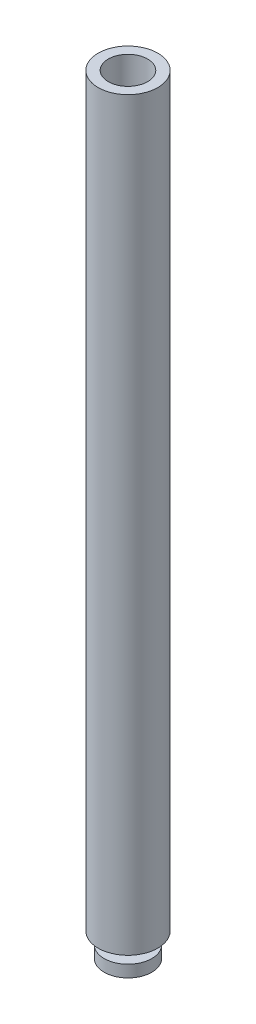
ISO-10303-21;
HEADER;
FILE_DESCRIPTION(('STEP AP214'),'2;1');
FILE_NAME('part.step','',(''),(''),'','','');
FILE_SCHEMA(('AUTOMOTIVE_DESIGN { 1 0 10303 214 1 1 1 1 }'));
ENDSEC;
DATA;
#1=APPLICATION_CONTEXT('core data for automotive mechanical design processes');
#2=APPLICATION_PROTOCOL_DEFINITION('international standard','automotive_design',2000,#1);
#3=PRODUCT_CONTEXT('',#1,'mechanical');
#4=PRODUCT('Part','Part','',(#3));
#5=PRODUCT_RELATED_PRODUCT_CATEGORY('part','',(#4));
#6=PRODUCT_DEFINITION_FORMATION('','',#4);
#7=PRODUCT_DEFINITION_CONTEXT('part definition',#1,'design');
#8=PRODUCT_DEFINITION('design','',#6,#7);
#9=PRODUCT_DEFINITION_SHAPE('','',#8);
#10=(LENGTH_UNIT() NAMED_UNIT(*) SI_UNIT(.MILLI.,.METRE.));
#11=(NAMED_UNIT(*) PLANE_ANGLE_UNIT() SI_UNIT($,.RADIAN.));
#12=(NAMED_UNIT(*) SI_UNIT($,.STERADIAN.) SOLID_ANGLE_UNIT());
#13=UNCERTAINTY_MEASURE_WITH_UNIT(LENGTH_MEASURE(1.E-05),#10,'distance_accuracy_value','');
#14=(GEOMETRIC_REPRESENTATION_CONTEXT(3) GLOBAL_UNCERTAINTY_ASSIGNED_CONTEXT((#13)) GLOBAL_UNIT_ASSIGNED_CONTEXT((#10,
#11,#12)) REPRESENTATION_CONTEXT('',''));
#15=CARTESIAN_POINT('',(0.,0.,0.));
#16=DIRECTION('',(0.,0.,1.));
#17=DIRECTION('',(1.,0.,0.));
#18=AXIS2_PLACEMENT_3D('',#15,#16,#17);
#19=CARTESIAN_POINT('',(-0.522013311509166,62.5,-0.51113803418606));
#20=DIRECTION('',(0.,-1.,0.));
#21=DIRECTION('',(0.,0.,-1.));
#22=AXIS2_PLACEMENT_3D('',#19,#20,#21);
#23=CYLINDRICAL_SURFACE('',#22,2.5);
#24=CARTESIAN_POINT('',(-0.522013311509166,62.5,-0.51113803418606));
#25=DIRECTION('',(0.,1.,0.));
#26=DIRECTION('',(0.,0.,1.));
#27=AXIS2_PLACEMENT_3D('',#24,#25,#26);
#28=CIRCLE('',#27,2.5);
#29=CARTESIAN_POINT('',(-0.522013311509166,62.5,1.98886196581394));
#30=VERTEX_POINT('',#29);
#31=EDGE_CURVE('E52',#30,#30,#28,.T.);
#32=ORIENTED_EDGE('',*,*,#31,.F.);
#33=EDGE_LOOP('',(#32));
#34=FACE_BOUND('',#33,.T.);
#35=CARTESIAN_POINT('',(-0.522013311509166,0.,-0.51113803418606));
#36=DIRECTION('',(0.,1.,0.));
#37=DIRECTION('',(0.,0.,1.));
#38=AXIS2_PLACEMENT_3D('',#35,#36,#37);
#39=CIRCLE('',#38,2.5);
#40=CARTESIAN_POINT('',(-0.522013311509166,0.,1.98886196581394));
#41=VERTEX_POINT('',#40);
#42=EDGE_CURVE('E47',#41,#41,#39,.T.);
#43=ORIENTED_EDGE('',*,*,#42,.T.);
#44=EDGE_LOOP('',(#43));
#45=FACE_BOUND('',#44,.T.);
#46=ADVANCED_FACE('F44',(#34,#45),#23,.T.);
#47=CARTESIAN_POINT('',(-0.522013311509166,62.5,-0.51113803418606));
#48=DIRECTION('',(0.,1.,0.));
#49=DIRECTION('',(0.,0.,1.));
#50=AXIS2_PLACEMENT_3D('',#47,#48,#49);
#51=PLANE('',#50);
#52=CARTESIAN_POINT('',(-0.522013311509166,62.5,-0.51113803418606));
#53=DIRECTION('',(0.,1.,0.));
#54=DIRECTION('',(0.,0.,1.));
#55=AXIS2_PLACEMENT_3D('',#52,#53,#54);
#56=CIRCLE('',#55,1.65);
#57=CARTESIAN_POINT('',(-0.522013311509166,62.5,1.13886196581394));
#58=VERTEX_POINT('',#57);
#59=EDGE_CURVE('E72',#58,#58,#56,.T.);
#60=ORIENTED_EDGE('',*,*,#59,.F.);
#61=EDGE_LOOP('',(#60));
#62=FACE_BOUND('',#61,.T.);
#63=ORIENTED_EDGE('',*,*,#31,.T.);
#64=EDGE_LOOP('',(#63));
#65=FACE_BOUND('',#64,.T.);
#66=ADVANCED_FACE('F89',(#62,#65),#51,.T.);
#67=CARTESIAN_POINT('',(-0.522013311509166,0.,-0.51113803418606));
#68=DIRECTION('',(0.,1.,0.));
#69=DIRECTION('',(0.,0.,1.));
#70=AXIS2_PLACEMENT_3D('',#67,#68,#69);
#71=PLANE('',#70);
#72=CARTESIAN_POINT('',(-0.522013311509166,0.,-0.51113803418606));
#73=DIRECTION('',(0.,-1.,0.));
#74=DIRECTION('',(0.,0.,-1.));
#75=AXIS2_PLACEMENT_3D('',#72,#73,#74);
#76=CIRCLE('',#75,1.);
#77=CARTESIAN_POINT('',(-0.522013311509166,0.,-1.51113803418606));
#78=VERTEX_POINT('',#77);
#79=EDGE_CURVE('E10',#78,#78,#76,.T.);
#80=ORIENTED_EDGE('',*,*,#79,.F.);
#81=EDGE_LOOP('',(#80));
#82=FACE_BOUND('',#81,.T.);
#83=ORIENTED_EDGE('',*,*,#42,.F.);
#84=EDGE_LOOP('',(#83));
#85=FACE_BOUND('',#84,.T.);
#86=ADVANCED_FACE('F92',(#82,#85),#71,.F.);
#87=CARTESIAN_POINT('',(-0.522013311509166,-1.,-0.51113803418606));
#88=DIRECTION('',(0.,1.,0.));
#89=DIRECTION('',(0.,0.,1.));
#90=AXIS2_PLACEMENT_3D('',#87,#88,#89);
#91=CYLINDRICAL_SURFACE('',#90,1.);
#92=CARTESIAN_POINT('',(-0.522013311509166,-1.,-0.51113803418606));
#93=DIRECTION('',(0.,-1.,0.));
#94=DIRECTION('',(0.,0.,-1.));
#95=AXIS2_PLACEMENT_3D('',#92,#93,#94);
#96=CIRCLE('',#95,1.);
#97=CARTESIAN_POINT('',(-0.522013311509166,-1.,-1.51113803418606));
#98=VERTEX_POINT('',#97);
#99=EDGE_CURVE('E59',#98,#98,#96,.T.);
#100=ORIENTED_EDGE('',*,*,#99,.F.);
#101=EDGE_LOOP('',(#100));
#102=FACE_BOUND('',#101,.T.);
#103=ORIENTED_EDGE('',*,*,#79,.T.);
#104=EDGE_LOOP('',(#103));
#105=FACE_BOUND('',#104,.T.);
#106=ADVANCED_FACE('F103',(#102,#105),#91,.T.);
#107=CARTESIAN_POINT('',(-0.522013311509166,-2.,-0.51113803418606));
#108=DIRECTION('',(0.,1.,0.));
#109=DIRECTION('',(0.,0.,1.));
#110=AXIS2_PLACEMENT_3D('',#107,#108,#109);
#111=CYLINDRICAL_SURFACE('',#110,2.);
#112=CARTESIAN_POINT('',(-0.522013311509166,-2.,-0.51113803418606));
#113=DIRECTION('',(0.,-1.,0.));
#114=DIRECTION('',(0.,0.,-1.));
#115=AXIS2_PLACEMENT_3D('',#112,#113,#114);
#116=CIRCLE('',#115,2.);
#117=CARTESIAN_POINT('',(-0.522013311509166,-2.,-2.51113803418606));
#118=VERTEX_POINT('',#117);
#119=EDGE_CURVE('E63',#118,#118,#116,.T.);
#120=ORIENTED_EDGE('',*,*,#119,.F.);
#121=EDGE_LOOP('',(#120));
#122=FACE_BOUND('',#121,.T.);
#123=CARTESIAN_POINT('',(-0.522013311509166,-1.,-0.51113803418606));
#124=DIRECTION('',(0.,-1.,0.));
#125=DIRECTION('',(0.,0.,-1.));
#126=AXIS2_PLACEMENT_3D('',#123,#124,#125);
#127=CIRCLE('',#126,2.);
#128=CARTESIAN_POINT('',(-0.522013311509166,-1.,-2.51113803418606));
#129=VERTEX_POINT('',#128);
#130=EDGE_CURVE('E64',#129,#129,#127,.T.);
#131=ORIENTED_EDGE('',*,*,#130,.T.);
#132=EDGE_LOOP('',(#131));
#133=FACE_BOUND('',#132,.T.);
#134=ADVANCED_FACE('F108',(#122,#133),#111,.T.);
#135=CARTESIAN_POINT('',(-0.522013311509166,-2.,-0.51113803418606));
#136=DIRECTION('',(0.,-1.,0.));
#137=DIRECTION('',(0.,0.,-1.));
#138=AXIS2_PLACEMENT_3D('',#135,#136,#137);
#139=PLANE('',#138);
#140=ORIENTED_EDGE('',*,*,#119,.T.);
#141=EDGE_LOOP('',(#140));
#142=FACE_BOUND('',#141,.T.);
#143=ADVANCED_FACE('F114',(#142),#139,.T.);
#144=CARTESIAN_POINT('',(-0.522013311509166,-1.,-0.51113803418606));
#145=DIRECTION('',(0.,-1.,0.));
#146=DIRECTION('',(0.,0.,-1.));
#147=AXIS2_PLACEMENT_3D('',#144,#145,#146);
#148=PLANE('',#147);
#149=ORIENTED_EDGE('',*,*,#99,.T.);
#150=EDGE_LOOP('',(#149));
#151=FACE_BOUND('',#150,.T.);
#152=ORIENTED_EDGE('',*,*,#130,.F.);
#153=EDGE_LOOP('',(#152));
#154=FACE_BOUND('',#153,.T.);
#155=ADVANCED_FACE('F85',(#151,#154),#148,.F.);
#156=CARTESIAN_POINT('',(-0.522013311509166,57.5,-0.51113803418606));
#157=DIRECTION('',(0.,1.,0.));
#158=DIRECTION('',(0.,0.,1.));
#159=AXIS2_PLACEMENT_3D('',#156,#157,#158);
#160=CYLINDRICAL_SURFACE('',#159,1.65);
#161=CARTESIAN_POINT('',(-0.522013311509166,57.5,-0.51113803418606));
#162=DIRECTION('',(0.,1.,0.));
#163=DIRECTION('',(0.,0.,1.));
#164=AXIS2_PLACEMENT_3D('',#161,#162,#163);
#165=CIRCLE('',#164,1.65);
#166=CARTESIAN_POINT('',(-0.522013311509166,57.5,1.13886196581394));
#167=VERTEX_POINT('',#166);
#168=EDGE_CURVE('E68',#167,#167,#165,.T.);
#169=ORIENTED_EDGE('',*,*,#168,.F.);
#170=EDGE_LOOP('',(#169));
#171=FACE_BOUND('',#170,.T.);
#172=ORIENTED_EDGE('',*,*,#59,.T.);
#173=EDGE_LOOP('',(#172));
#174=FACE_BOUND('',#173,.T.);
#175=ADVANCED_FACE('F82',(#171,#174),#160,.F.);
#176=CARTESIAN_POINT('',(-0.522013311509166,57.5,-0.51113803418606));
#177=DIRECTION('',(0.,1.,0.));
#178=DIRECTION('',(0.,0.,1.));
#179=AXIS2_PLACEMENT_3D('',#176,#177,#178);
#180=PLANE('',#179);
#181=ORIENTED_EDGE('',*,*,#168,.T.);
#182=EDGE_LOOP('',(#181));
#183=FACE_BOUND('',#182,.T.);
#184=ADVANCED_FACE('F80',(#183),#180,.T.);
#185=CLOSED_SHELL('',(#46,#66,#86,#106,#134,#143,#155,#175,#184));
#186=MANIFOLD_SOLID_BREP('B2',#185);
#187=ADVANCED_BREP_SHAPE_REPRESENTATION('',(#18,#186),#14);
#188=SHAPE_DEFINITION_REPRESENTATION(#9,#187);
ENDSEC;
END-ISO-10303-21;
